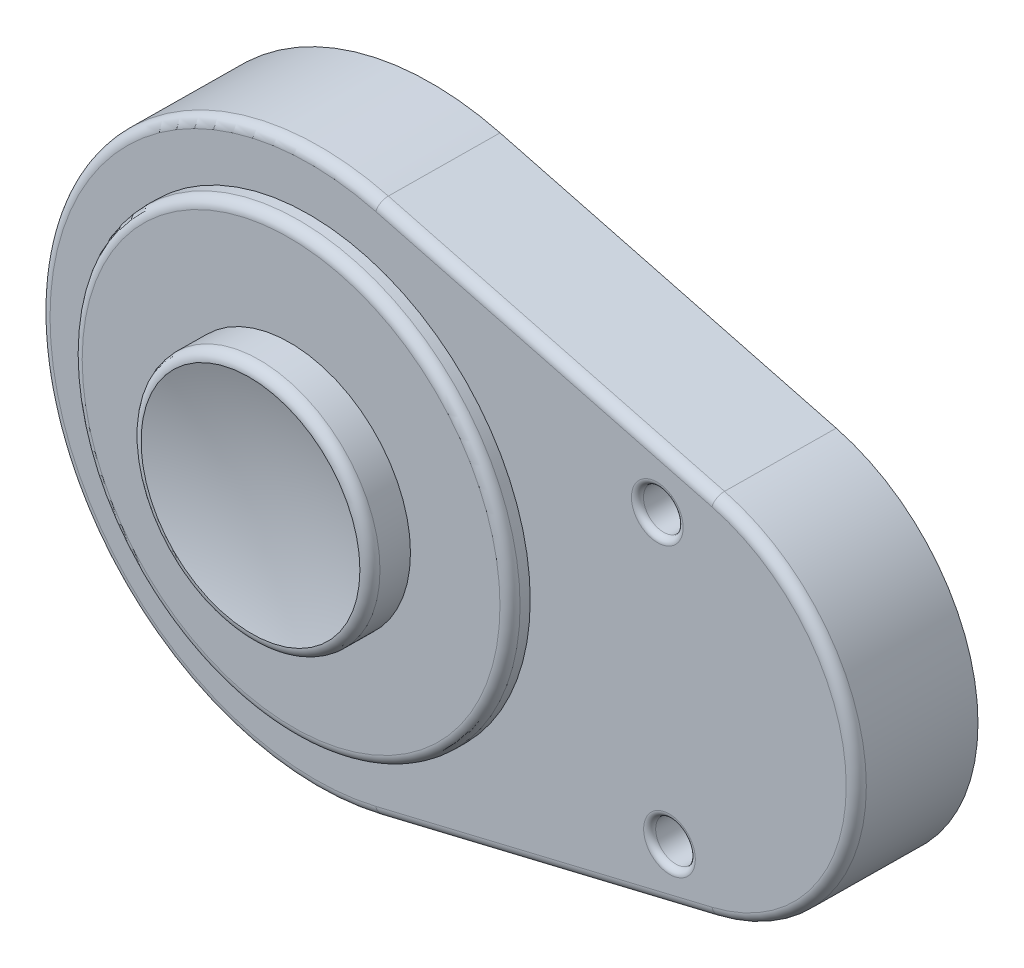
ISO-10303-21;
HEADER;
FILE_DESCRIPTION(('STEP AP214'),'2;1');
FILE_NAME('part.step','',(''),(''),'','','');
FILE_SCHEMA(('AUTOMOTIVE_DESIGN { 1 0 10303 214 1 1 1 1 }'));
ENDSEC;
DATA;
#1=APPLICATION_CONTEXT('core data for automotive mechanical design processes');
#2=APPLICATION_PROTOCOL_DEFINITION('international standard','automotive_design',2000,#1);
#3=PRODUCT_CONTEXT('',#1,'mechanical');
#4=PRODUCT('Part','Part','',(#3));
#5=PRODUCT_RELATED_PRODUCT_CATEGORY('part','',(#4));
#6=PRODUCT_DEFINITION_FORMATION('','',#4);
#7=PRODUCT_DEFINITION_CONTEXT('part definition',#1,'design');
#8=PRODUCT_DEFINITION('design','',#6,#7);
#9=PRODUCT_DEFINITION_SHAPE('','',#8);
#10=(LENGTH_UNIT() NAMED_UNIT(*) SI_UNIT(.MILLI.,.METRE.));
#11=(NAMED_UNIT(*) PLANE_ANGLE_UNIT() SI_UNIT($,.RADIAN.));
#12=(NAMED_UNIT(*) SI_UNIT($,.STERADIAN.) SOLID_ANGLE_UNIT());
#13=UNCERTAINTY_MEASURE_WITH_UNIT(LENGTH_MEASURE(1.E-05),#10,'distance_accuracy_value','');
#14=(GEOMETRIC_REPRESENTATION_CONTEXT(3) GLOBAL_UNCERTAINTY_ASSIGNED_CONTEXT((#13)) GLOBAL_UNIT_ASSIGNED_CONTEXT((#10,
#11,#12)) REPRESENTATION_CONTEXT('',''));
#15=CARTESIAN_POINT('',(0.,0.,0.));
#16=DIRECTION('',(0.,0.,1.));
#17=DIRECTION('',(1.,0.,0.));
#18=AXIS2_PLACEMENT_3D('',#15,#16,#17);
#19=CARTESIAN_POINT('',(-0.913899219910125,294.000000000001,89.995359814914));
#20=DIRECTION('',(0.0101544357767432,0.,-0.999948442387934));
#21=DIRECTION('',(-0.999948442387934,0.,-0.0101544357767432));
#22=AXIS2_PLACEMENT_3D('',#19,#20,#21);
#23=CYLINDRICAL_SURFACE('',#22,46.9225149813001);
#24=DIRECTION('',(0.0101544357767432,0.,-0.999948442387934));
#25=VECTOR('',#24,1.);
#26=CARTESIAN_POINT('',(10.3753588625768,339.544065709367,90.1100017717452));
#27=LINE('',#26,#25);
#28=CARTESIAN_POINT('',(10.4007449520186,339.544065709367,87.6101306657754));
#29=VERTEX_POINT('',#28);
#30=CARTESIAN_POINT('',(10.6799919358791,339.544065709367,60.1115485001072));
#31=VERTEX_POINT('',#30);
#32=EDGE_CURVE('E87',#29,#31,#27,.T.);
#33=ORIENTED_EDGE('',*,*,#32,.F.);
#34=CARTESIAN_POINT('',(-0.888513130468267,294.000000000001,87.4954887089442));
#35=DIRECTION('',(-0.0101544357767432,0.,0.999948442387934));
#36=DIRECTION('',(0.999948442387934,0.,0.0101544357767432));
#37=AXIS2_PLACEMENT_3D('',#34,#35,#36);
#38=CIRCLE('',#37,46.9225149813001);
#39=CARTESIAN_POINT('',(10.4007449520186,248.455934290634,87.6101306657754));
#40=VERTEX_POINT('',#39);
#41=EDGE_CURVE('E145',#29,#40,#38,.F.);
#42=ORIENTED_EDGE('',*,*,#41,.T.);
#43=DIRECTION('',(0.0101544357767432,0.,-0.999948442387934));
#44=VECTOR('',#43,1.);
#45=CARTESIAN_POINT('',(10.3753588625768,248.455934290634,90.1100017717452));
#46=LINE('',#45,#44);
#47=CARTESIAN_POINT('',(10.6799919358791,248.455934290634,60.1115485001072));
#48=VERTEX_POINT('',#47);
#49=EDGE_CURVE('E109',#40,#48,#46,.T.);
#50=ORIENTED_EDGE('',*,*,#49,.T.);
#51=CARTESIAN_POINT('',(-0.609266146607829,294.000000000001,59.996906543276));
#52=DIRECTION('',(-0.0101544357767432,0.,0.999948442387934));
#53=DIRECTION('',(0.999948442387934,0.,0.0101544357767432));
#54=AXIS2_PLACEMENT_3D('',#51,#52,#53);
#55=CIRCLE('',#54,46.9225149813001);
#56=EDGE_CURVE('E105',#48,#31,#55,.T.);
#57=ORIENTED_EDGE('',*,*,#56,.T.);
#58=EDGE_LOOP('',(#33,#42,#50,#57));
#59=FACE_BOUND('',#58,.T.);
#60=ADVANCED_FACE('F32',(#59),#23,.T.);
#61=CARTESIAN_POINT('',(10.3753588625768,339.544065709367,90.1100017717452));
#62=DIRECTION('',(-0.240593627323387,-0.970622860422481,-0.00244321850346071));
#63=DIRECTION('',(0.970625757413055,-0.240594345416375,0.));
#64=AXIS2_PLACEMENT_3D('',#61,#62,#63);
#65=PLANE('',#64);
#66=DIRECTION('',(0.0101544357767432,0.,-0.999948442387934));
#67=VECTOR('',#66,1.);
#68=CARTESIAN_POINT('',(-74.1083462192989,360.487665938941,89.2520731815606));
#69=LINE('',#68,#67);
#70=CARTESIAN_POINT('',(-74.082960129857,360.487665938941,86.7522020755908));
#71=VERTEX_POINT('',#70);
#72=CARTESIAN_POINT('',(-73.8037131459966,360.487665938941,59.2536199099226));
#73=VERTEX_POINT('',#72);
#74=EDGE_CURVE('E99',#71,#73,#69,.T.);
#75=ORIENTED_EDGE('',*,*,#74,.F.);
#76=DIRECTION('',(-0.970572817425582,0.240606032395866,-0.00985612749959888));
#77=VECTOR('',#76,1.);
#78=CARTESIAN_POINT('',(10.4007449520186,339.544065709367,87.6101306657754));
#79=LINE('',#78,#77);
#80=EDGE_CURVE('E93',#71,#29,#79,.F.);
#81=ORIENTED_EDGE('',*,*,#80,.T.);
#82=ORIENTED_EDGE('',*,*,#32,.T.);
#83=DIRECTION('',(-0.970572817425581,0.240606032395866,-0.00985612749959894));
#84=VECTOR('',#83,1.);
#85=CARTESIAN_POINT('',(10.6799919358791,339.544065709367,60.1115485001072));
#86=LINE('',#85,#84);
#87=EDGE_CURVE('E90',#31,#73,#86,.T.);
#88=ORIENTED_EDGE('',*,*,#87,.T.);
#89=EDGE_LOOP('',(#75,#81,#82,#88));
#90=FACE_BOUND('',#89,.T.);
#91=ADVANCED_FACE('F89',(#90),#65,.F.);
#92=CARTESIAN_POINT('',(-90.5890096909508,294.000000000001,89.0847127140735));
#93=DIRECTION('',(0.0101544357767432,0.,-0.999948442387934));
#94=DIRECTION('',(-0.999948442387934,0.,-0.0101544357767432));
#95=AXIS2_PLACEMENT_3D('',#92,#93,#94);
#96=CYLINDRICAL_SURFACE('',#95,68.5);
#97=DIRECTION('',(0.0101544357767432,0.,-0.999948442387934));
#98=VECTOR('',#97,1.);
#99=CARTESIAN_POINT('',(-74.1083462192989,227.512334061061,89.2520731815606));
#100=LINE('',#99,#98);
#101=CARTESIAN_POINT('',(-74.082960129857,227.512334061061,86.7522020755908));
#102=VERTEX_POINT('',#101);
#103=CARTESIAN_POINT('',(-73.8037131459966,227.512334061061,59.2536199099226));
#104=VERTEX_POINT('',#103);
#105=EDGE_CURVE('E123',#102,#104,#100,.T.);
#106=ORIENTED_EDGE('',*,*,#105,.F.);
#107=CARTESIAN_POINT('',(-90.563623601509,294.000000000001,86.5848416081037));
#108=DIRECTION('',(-0.0101544357767432,0.,0.999948442387934));
#109=DIRECTION('',(0.999948442387934,0.,0.0101544357767432));
#110=AXIS2_PLACEMENT_3D('',#107,#108,#109);
#111=CIRCLE('',#110,68.5);
#112=EDGE_CURVE('E48',#102,#71,#111,.F.);
#113=ORIENTED_EDGE('',*,*,#112,.T.);
#114=ORIENTED_EDGE('',*,*,#74,.T.);
#115=CARTESIAN_POINT('',(-90.2843766176485,294.000000000001,59.0862594424355));
#116=DIRECTION('',(-0.0101544357767432,0.,0.999948442387934));
#117=DIRECTION('',(0.999948442387934,0.,0.0101544357767432));
#118=AXIS2_PLACEMENT_3D('',#115,#116,#117);
#119=CIRCLE('',#118,68.5);
#120=EDGE_CURVE('E107',#73,#104,#119,.T.);
#121=ORIENTED_EDGE('',*,*,#120,.T.);
#122=EDGE_LOOP('',(#106,#113,#114,#121));
#123=FACE_BOUND('',#122,.T.);
#124=ADVANCED_FACE('F216',(#123),#96,.T.);
#125=CARTESIAN_POINT('',(-74.1083462192989,227.512334061061,89.2520731815606));
#126=DIRECTION('',(-0.240593627323385,0.970622860422482,-0.0024432185034609));
#127=DIRECTION('',(-0.970625757413055,-0.240594345416374,0.));
#128=AXIS2_PLACEMENT_3D('',#125,#126,#127);
#129=PLANE('',#128);
#130=ORIENTED_EDGE('',*,*,#49,.F.);
#131=DIRECTION('',(0.970572817425582,0.240606032395864,0.00985612749959883));
#132=VECTOR('',#131,1.);
#133=CARTESIAN_POINT('',(-74.082960129857,227.512334061061,86.7522020755908));
#134=LINE('',#133,#132);
#135=EDGE_CURVE('E56',#40,#102,#134,.F.);
#136=ORIENTED_EDGE('',*,*,#135,.T.);
#137=ORIENTED_EDGE('',*,*,#105,.T.);
#138=DIRECTION('',(0.970572817425582,0.240606032395864,0.00985612749959879));
#139=VECTOR('',#138,1.);
#140=CARTESIAN_POINT('',(-73.8037131459966,227.512334061061,59.2536199099226));
#141=LINE('',#140,#139);
#142=EDGE_CURVE('E120',#104,#48,#141,.T.);
#143=ORIENTED_EDGE('',*,*,#142,.T.);
#144=EDGE_LOOP('',(#130,#136,#137,#143));
#145=FACE_BOUND('',#144,.T.);
#146=ADVANCED_FACE('F208',(#145),#129,.F.);
#147=CARTESIAN_POINT('',(-0.913899219910125,294.000000000001,89.995359814914));
#148=DIRECTION('',(-0.0101544357767432,0.,0.999948442387934));
#149=DIRECTION('',(0.999948442387934,0.,0.0101544357767432));
#150=AXIS2_PLACEMENT_3D('',#147,#148,#149);
#151=PLANE('',#150);
#152=CARTESIAN_POINT('',(-0.913899219910086,259.067133874063,89.995359814914));
#153=DIRECTION('',(-0.0101544357767432,0.,0.999948442387934));
#154=DIRECTION('',(0.999948442387934,0.,0.0101544357767432));
#155=AXIS2_PLACEMENT_3D('',#152,#153,#154);
#156=CIRCLE('',#155,6.50000000000002);
#157=CARTESIAN_POINT('',(5.58576565561151,259.067133874063,90.0613636474629));
#158=VERTEX_POINT('',#157);
#159=EDGE_CURVE('E41',#158,#158,#156,.F.);
#160=ORIENTED_EDGE('',*,*,#159,.T.);
#161=EDGE_LOOP('',(#160));
#162=FACE_BOUND('',#161,.T.);
#163=CARTESIAN_POINT('',(-3.97874289420973,329.000000000001,89.9642364520113));
#164=DIRECTION('',(-0.0101544357767432,0.,0.999948442387934));
#165=DIRECTION('',(0.999948442387934,0.,0.0101544357767432));
#166=AXIS2_PLACEMENT_3D('',#163,#164,#165);
#167=CIRCLE('',#166,6.5);
#168=CARTESIAN_POINT('',(2.52092198131185,329.000000000001,90.0302402845602));
#169=VERTEX_POINT('',#168);
#170=EDGE_CURVE('E171',#169,#169,#167,.F.);
#171=ORIENTED_EDGE('',*,*,#170,.T.);
#172=EDGE_LOOP('',(#171));
#173=FACE_BOUND('',#172,.T.);
#174=DIRECTION('',(0.970572817425582,0.240606032395864,0.00985612749959883));
#175=VECTOR('',#174,1.);
#176=CARTESIAN_POINT('',(9.77387479426833,250.882491441691,90.1038937254866));
#177=LINE('',#176,#175);
#178=CARTESIAN_POINT('',(-74.7098302876073,229.938891212117,89.245965135302));
#179=VERTEX_POINT('',#178);
#180=CARTESIAN_POINT('',(9.77387479426833,250.882491441691,90.1038937254866));
#181=VERTEX_POINT('',#180);
#182=EDGE_CURVE('E140',#179,#181,#177,.T.);
#183=ORIENTED_EDGE('',*,*,#182,.T.);
#184=CARTESIAN_POINT('',(-0.913899219910125,294.000000000001,89.995359814914));
#185=DIRECTION('',(-0.0101544357767432,0.,0.999948442387934));
#186=DIRECTION('',(0.999948442387934,0.,0.0101544357767432));
#187=AXIS2_PLACEMENT_3D('',#184,#185,#186);
#188=CIRCLE('',#187,44.4225149813001);
#189=CARTESIAN_POINT('',(9.7738747942683,337.117508558311,90.1038937254866));
#190=VERTEX_POINT('',#189);
#191=EDGE_CURVE('E142',#181,#190,#188,.T.);
#192=ORIENTED_EDGE('',*,*,#191,.T.);
#193=DIRECTION('',(-0.970572817425582,0.240606032395866,-0.00985612749959888));
#194=VECTOR('',#193,1.);
#195=CARTESIAN_POINT('',(-74.7098302876074,358.061108787885,89.2459651353019));
#196=LINE('',#195,#194);
#197=CARTESIAN_POINT('',(-74.7098302876074,358.061108787885,89.2459651353019));
#198=VERTEX_POINT('',#197);
#199=EDGE_CURVE('E135',#190,#198,#196,.T.);
#200=ORIENTED_EDGE('',*,*,#199,.T.);
#201=CARTESIAN_POINT('',(-90.5890096909508,294.000000000001,89.0847127140735));
#202=DIRECTION('',(-0.0101544357767432,0.,0.999948442387934));
#203=DIRECTION('',(0.999948442387934,0.,0.0101544357767432));
#204=AXIS2_PLACEMENT_3D('',#201,#202,#203);
#205=CIRCLE('',#204,66.);
#206=EDGE_CURVE('E137',#198,#179,#205,.T.);
#207=ORIENTED_EDGE('',*,*,#206,.T.);
#208=EDGE_LOOP('',(#183,#192,#200,#207));
#209=FACE_BOUND('',#208,.T.);
#210=CARTESIAN_POINT('',(-90.9046190889751,294.000000000001,89.0815077134686));
#211=DIRECTION('',(-0.0101544357767432,0.,0.999948442387934));
#212=DIRECTION('',(0.999948442387934,0.,0.0101544357767432));
#213=AXIS2_PLACEMENT_3D('',#210,#211,#212);
#214=CIRCLE('',#213,55.);
#215=CARTESIAN_POINT('',(-35.9074547576387,294.000000000001,89.6400016811895));
#216=VERTEX_POINT('',#215);
#217=EDGE_CURVE('E98',#216,#216,#214,.T.);
#218=ORIENTED_EDGE('',*,*,#217,.F.);
#219=EDGE_LOOP('',(#218));
#220=FACE_BOUND('',#219,.T.);
#221=ADVANCED_FACE('F177',(#162,#173,#209,#220),#151,.T.);
#222=CARTESIAN_POINT('',(-0.609266146607829,294.000000000001,59.996906543276));
#223=DIRECTION('',(-0.0101544357767432,0.,0.999948442387934));
#224=DIRECTION('',(0.999948442387934,0.,0.0101544357767432));
#225=AXIS2_PLACEMENT_3D('',#222,#223,#224);
#226=PLANE('',#225);
#227=CARTESIAN_POINT('',(-3.67410982090744,329.000000000001,59.9657831803733));
#228=DIRECTION('',(-0.0101544357767432,0.,0.999948442387934));
#229=DIRECTION('',(0.999948442387934,0.,0.0101544357767432));
#230=AXIS2_PLACEMENT_3D('',#227,#228,#229);
#231=CIRCLE('',#230,3.0000000000433);
#232=CARTESIAN_POINT('',(-0.674264493700337,329.000000000001,59.9962464877039));
#233=VERTEX_POINT('',#232);
#234=EDGE_CURVE('E129',#233,#233,#231,.T.);
#235=ORIENTED_EDGE('',*,*,#234,.T.);
#236=EDGE_LOOP('',(#235));
#237=FACE_BOUND('',#236,.T.);
#238=CARTESIAN_POINT('',(-0.60926614660779,259.067133874063,59.996906543276));
#239=DIRECTION('',(-0.0101544357767432,0.,0.999948442387934));
#240=DIRECTION('',(0.999948442387934,0.,0.0101544357767432));
#241=AXIS2_PLACEMENT_3D('',#238,#239,#240);
#242=CIRCLE('',#241,3.00000000022555);
#243=CARTESIAN_POINT('',(2.39057918078155,259.067133874063,60.0273698506085));
#244=VERTEX_POINT('',#243);
#245=EDGE_CURVE('E134',#244,#244,#242,.T.);
#246=ORIENTED_EDGE('',*,*,#245,.T.);
#247=EDGE_LOOP('',(#246));
#248=FACE_BOUND('',#247,.T.);
#249=ORIENTED_EDGE('',*,*,#56,.F.);
#250=ORIENTED_EDGE('',*,*,#142,.F.);
#251=ORIENTED_EDGE('',*,*,#120,.F.);
#252=ORIENTED_EDGE('',*,*,#87,.F.);
#253=EDGE_LOOP('',(#249,#250,#251,#252));
#254=FACE_BOUND('',#253,.T.);
#255=ADVANCED_FACE('F103',(#237,#248,#254),#226,.F.);
#256=CARTESIAN_POINT('',(-90.9553912678588,294.000000000001,94.0812499254083));
#257=DIRECTION('',(0.0101544357767432,0.,-0.999948442387934));
#258=DIRECTION('',(-0.999948442387934,0.,-0.0101544357767432));
#259=AXIS2_PLACEMENT_3D('',#256,#257,#258);
#260=CYLINDRICAL_SURFACE('',#259,55.);
#261=CARTESIAN_POINT('',(-90.930005178417,294.000000000001,91.5813788194384));
#262=DIRECTION('',(-0.0101544357767432,0.,0.999948442387934));
#263=DIRECTION('',(0.999948442387934,0.,0.0101544357767432));
#264=AXIS2_PLACEMENT_3D('',#261,#262,#263);
#265=CIRCLE('',#264,55.);
#266=CARTESIAN_POINT('',(-35.9328408470806,294.000000000001,92.1398727871593));
#267=VERTEX_POINT('',#266);
#268=EDGE_CURVE('E152',#267,#267,#265,.F.);
#269=ORIENTED_EDGE('',*,*,#268,.T.);
#270=EDGE_LOOP('',(#269));
#271=FACE_BOUND('',#270,.T.);
#272=ORIENTED_EDGE('',*,*,#217,.T.);
#273=EDGE_LOOP('',(#272));
#274=FACE_BOUND('',#273,.T.);
#275=ADVANCED_FACE('F205',(#271,#274),#260,.T.);
#276=CARTESIAN_POINT('',(-90.9553912678588,294.000000000001,94.0812499254083));
#277=DIRECTION('',(-0.0101544357767432,0.,0.999948442387934));
#278=DIRECTION('',(0.999948442387934,0.,0.0101544357767432));
#279=AXIS2_PLACEMENT_3D('',#276,#277,#278);
#280=PLANE('',#279);
#281=CARTESIAN_POINT('',(-90.9553912678588,294.000000000001,94.0812499254083));
#282=DIRECTION('',(-0.0101544357767432,0.,0.999948442387934));
#283=DIRECTION('',(0.999948442387934,0.,0.0101544357767432));
#284=AXIS2_PLACEMENT_3D('',#281,#282,#283);
#285=CIRCLE('',#284,52.5);
#286=CARTESIAN_POINT('',(-38.4580980424923,294.000000000001,94.6143578036873));
#287=VERTEX_POINT('',#286);
#288=EDGE_CURVE('E149',#287,#287,#285,.T.);
#289=ORIENTED_EDGE('',*,*,#288,.T.);
#290=EDGE_LOOP('',(#289));
#291=FACE_BOUND('',#290,.T.);
#292=CARTESIAN_POINT('',(-90.9553912678588,294.000000000001,94.0812499254083));
#293=DIRECTION('',(-0.0101544357767432,0.,0.999948442387934));
#294=DIRECTION('',(0.999948442387934,0.,0.0101544357767432));
#295=AXIS2_PLACEMENT_3D('',#292,#293,#294);
#296=CIRCLE('',#295,30.);
#297=CARTESIAN_POINT('',(-60.9569379962208,294.000000000001,94.3858829987106));
#298=VERTEX_POINT('',#297);
#299=EDGE_CURVE('E138',#298,#298,#296,.T.);
#300=ORIENTED_EDGE('',*,*,#299,.F.);
#301=EDGE_LOOP('',(#300));
#302=FACE_BOUND('',#301,.T.);
#303=ADVANCED_FACE('F283',(#291,#302),#280,.T.);
#304=CARTESIAN_POINT('',(-91.0569356256263,294.000000000001,104.080734349288));
#305=DIRECTION('',(0.0101544357767432,0.,-0.999948442387934));
#306=DIRECTION('',(-0.999948442387934,0.,-0.0101544357767432));
#307=AXIS2_PLACEMENT_3D('',#304,#305,#306);
#308=CYLINDRICAL_SURFACE('',#307,30.);
#309=CARTESIAN_POINT('',(-91.0315495361844,294.000000000001,101.580863243318));
#310=DIRECTION('',(-0.0101544357767432,0.,0.999948442387934));
#311=DIRECTION('',(0.999948442387934,0.,0.0101544357767432));
#312=AXIS2_PLACEMENT_3D('',#309,#310,#311);
#313=CIRCLE('',#312,30.);
#314=CARTESIAN_POINT('',(-61.0330962645464,294.000000000001,101.88549631662));
#315=VERTEX_POINT('',#314);
#316=EDGE_CURVE('E155',#315,#315,#313,.F.);
#317=ORIENTED_EDGE('',*,*,#316,.T.);
#318=EDGE_LOOP('',(#317));
#319=FACE_BOUND('',#318,.T.);
#320=ORIENTED_EDGE('',*,*,#299,.T.);
#321=EDGE_LOOP('',(#320));
#322=FACE_BOUND('',#321,.T.);
#323=ADVANCED_FACE('F280',(#319,#322),#308,.T.);
#324=CARTESIAN_POINT('',(-91.996538261093,294.000000000001,196.607213658996));
#325=DIRECTION('',(0.,0.,1.));
#326=DIRECTION('',(1.,0.,0.));
#327=AXIS2_PLACEMENT_3D('',#324,#325,#326);
#328=SPHERICAL_SURFACE('',#327,96.5312499999999);
#329=CARTESIAN_POINT('',(-91.996538261093,294.000000000001,196.607213658996));
#330=DIRECTION('',(-0.0101544357767432,0.,0.999948442387934));
#331=DIRECTION('',(0.999948442387934,0.,0.0101544357767432));
#332=AXIS2_PLACEMENT_3D('',#329,#330,#331);
#333=SPHERICAL_SURFACE('',#332,96.5312499999999);
#334=CARTESIAN_POINT('',(-91.0569356256263,294.000000000001,104.080734349288));
#335=DIRECTION('',(-0.0101544357767432,0.,0.999948442387934));
#336=DIRECTION('',(0.999948442387934,0.,0.0101544357767432));
#337=AXIS2_PLACEMENT_3D('',#334,#335,#336);
#338=CIRCLE('',#337,27.5);
#339=CARTESIAN_POINT('',(-63.5583534599581,294.000000000001,104.359981333148));
#340=VERTEX_POINT('',#339);
#341=EDGE_CURVE('E36',#340,#340,#338,.T.);
#342=ORIENTED_EDGE('',*,*,#341,.T.);
#343=EDGE_LOOP('',(#342));
#344=FACE_BOUND('',#343,.T.);
#345=ADVANCED_FACE('F34',(#344),#333,.F.);
#346=CARTESIAN_POINT('',(-0.710810504375222,259.067133874063,69.9963909671554));
#347=DIRECTION('',(-0.0101544357767432,0.,0.999948442387934));
#348=DIRECTION('',(0.999948442387934,0.,0.0101544357767432));
#349=AXIS2_PLACEMENT_3D('',#346,#347,#348);
#350=CYLINDRICAL_SURFACE('',#349,5.00000000000002);
#351=CARTESIAN_POINT('',(-0.898667566244971,259.067133874063,88.4954371513321));
#352=DIRECTION('',(-0.0101544357767432,0.,0.999948442387934));
#353=DIRECTION('',(0.999948442387934,0.,0.0101544357767432));
#354=AXIS2_PLACEMENT_3D('',#351,#352,#353);
#355=CIRCLE('',#354,5.00000000000002);
#356=CARTESIAN_POINT('',(4.10107464569472,259.067133874063,88.5462093302158));
#357=VERTEX_POINT('',#356);
#358=EDGE_CURVE('E159',#357,#357,#355,.T.);
#359=ORIENTED_EDGE('',*,*,#358,.T.);
#360=EDGE_LOOP('',(#359));
#361=FACE_BOUND('',#360,.T.);
#362=CARTESIAN_POINT('',(-0.710810504375222,259.067133874063,69.9963909671554));
#363=DIRECTION('',(-0.0101544357767432,0.,0.999948442387934));
#364=DIRECTION('',(0.999948442387934,0.,0.0101544357767432));
#365=AXIS2_PLACEMENT_3D('',#362,#363,#364);
#366=CIRCLE('',#365,5.00000000000002);
#367=CARTESIAN_POINT('',(4.28893170756447,259.067133874063,70.0471631460391));
#368=VERTEX_POINT('',#367);
#369=EDGE_CURVE('E114',#368,#368,#366,.T.);
#370=ORIENTED_EDGE('',*,*,#369,.F.);
#371=EDGE_LOOP('',(#370));
#372=FACE_BOUND('',#371,.T.);
#373=ADVANCED_FACE('F188',(#361,#372),#350,.F.);
#374=CARTESIAN_POINT('',(-0.710810504375222,259.067133874063,69.9963909671554));
#375=DIRECTION('',(-0.0101544357767432,0.,0.999948442387934));
#376=DIRECTION('',(0.999948442387934,0.,0.0101544357767432));
#377=AXIS2_PLACEMENT_3D('',#374,#375,#376);
#378=PLANE('',#377);
#379=CARTESIAN_POINT('',(-0.710810504375222,259.067133874063,69.9963909671554));
#380=DIRECTION('',(-0.0101544357767432,0.,0.999948442387934));
#381=DIRECTION('',(0.999948442387934,0.,0.0101544357767432));
#382=AXIS2_PLACEMENT_3D('',#379,#380,#381);
#383=CIRCLE('',#382,3.00000000022555);
#384=CARTESIAN_POINT('',(2.28903482301412,259.067133874063,70.0268542744879));
#385=VERTEX_POINT('',#384);
#386=EDGE_CURVE('E131',#385,#385,#383,.T.);
#387=ORIENTED_EDGE('',*,*,#386,.F.);
#388=EDGE_LOOP('',(#387));
#389=FACE_BOUND('',#388,.T.);
#390=ORIENTED_EDGE('',*,*,#369,.T.);
#391=EDGE_LOOP('',(#390));
#392=FACE_BOUND('',#391,.T.);
#393=ADVANCED_FACE('F191',(#389,#392),#378,.T.);
#394=CARTESIAN_POINT('',(-3.77565417867487,329.000000000001,69.9652676042526));
#395=DIRECTION('',(-0.0101544357767432,0.,0.999948442387934));
#396=DIRECTION('',(0.999948442387934,0.,0.0101544357767432));
#397=AXIS2_PLACEMENT_3D('',#394,#395,#396);
#398=CYLINDRICAL_SURFACE('',#397,5.);
#399=CARTESIAN_POINT('',(-3.96351124054462,329.000000000001,88.4643137884294));
#400=DIRECTION('',(-0.0101544357767432,0.,0.999948442387934));
#401=DIRECTION('',(0.999948442387934,0.,0.0101544357767432));
#402=AXIS2_PLACEMENT_3D('',#399,#400,#401);
#403=CIRCLE('',#402,5.);
#404=CARTESIAN_POINT('',(1.03623097139506,329.000000000001,88.5150859673131));
#405=VERTEX_POINT('',#404);
#406=EDGE_CURVE('E11',#405,#405,#403,.T.);
#407=ORIENTED_EDGE('',*,*,#406,.T.);
#408=EDGE_LOOP('',(#407));
#409=FACE_BOUND('',#408,.T.);
#410=CARTESIAN_POINT('',(-3.77565417867487,329.000000000001,69.9652676042526));
#411=DIRECTION('',(-0.0101544357767432,0.,0.999948442387934));
#412=DIRECTION('',(0.999948442387934,0.,0.0101544357767432));
#413=AXIS2_PLACEMENT_3D('',#410,#411,#412);
#414=CIRCLE('',#413,5.);
#415=CARTESIAN_POINT('',(1.22408803326481,329.000000000001,70.0160397831364));
#416=VERTEX_POINT('',#415);
#417=EDGE_CURVE('E111',#416,#416,#414,.T.);
#418=ORIENTED_EDGE('',*,*,#417,.F.);
#419=EDGE_LOOP('',(#418));
#420=FACE_BOUND('',#419,.T.);
#421=ADVANCED_FACE('F258',(#409,#420),#398,.F.);
#422=CARTESIAN_POINT('',(-3.77565417867487,329.000000000001,69.9652676042526));
#423=DIRECTION('',(-0.0101544357767432,0.,0.999948442387934));
#424=DIRECTION('',(0.999948442387934,0.,0.0101544357767432));
#425=AXIS2_PLACEMENT_3D('',#422,#423,#424);
#426=PLANE('',#425);
#427=CARTESIAN_POINT('',(-3.77565417867487,329.000000000001,69.9652676042526));
#428=DIRECTION('',(-0.0101544357767432,0.,0.999948442387934));
#429=DIRECTION('',(0.999948442387934,0.,0.0101544357767432));
#430=AXIS2_PLACEMENT_3D('',#427,#428,#429);
#431=CIRCLE('',#430,3.0000000000433);
#432=CARTESIAN_POINT('',(-0.775808851467769,329.000000000001,69.9957309115833));
#433=VERTEX_POINT('',#432);
#434=EDGE_CURVE('E126',#433,#433,#431,.T.);
#435=ORIENTED_EDGE('',*,*,#434,.F.);
#436=EDGE_LOOP('',(#435));
#437=FACE_BOUND('',#436,.T.);
#438=ORIENTED_EDGE('',*,*,#417,.T.);
#439=EDGE_LOOP('',(#438));
#440=FACE_BOUND('',#439,.T.);
#441=ADVANCED_FACE('F261',(#437,#440),#426,.T.);
#442=CARTESIAN_POINT('',(-3.65296229209155,329.000000000001,57.8833003162603));
#443=DIRECTION('',(-0.0101544357767432,0.,0.999948442387934));
#444=DIRECTION('',(0.999948442387934,0.,0.0101544357767432));
#445=AXIS2_PLACEMENT_3D('',#442,#443,#444);
#446=CYLINDRICAL_SURFACE('',#445,3.0000000000433);
#447=ORIENTED_EDGE('',*,*,#434,.T.);
#448=EDGE_LOOP('',(#447));
#449=FACE_BOUND('',#448,.T.);
#450=ORIENTED_EDGE('',*,*,#234,.F.);
#451=EDGE_LOOP('',(#450));
#452=FACE_BOUND('',#451,.T.);
#453=ADVANCED_FACE('F266',(#449,#452),#446,.F.);
#454=CARTESIAN_POINT('',(-0.588118617791899,259.067133874063,57.914423679163));
#455=DIRECTION('',(-0.0101544357767432,0.,0.999948442387934));
#456=DIRECTION('',(0.999948442387934,0.,0.0101544357767432));
#457=AXIS2_PLACEMENT_3D('',#454,#455,#456);
#458=CYLINDRICAL_SURFACE('',#457,3.00000000022555);
#459=ORIENTED_EDGE('',*,*,#386,.T.);
#460=EDGE_LOOP('',(#459));
#461=FACE_BOUND('',#460,.T.);
#462=ORIENTED_EDGE('',*,*,#245,.F.);
#463=EDGE_LOOP('',(#462));
#464=FACE_BOUND('',#463,.T.);
#465=ADVANCED_FACE('F243',(#461,#464),#458,.F.);
#466=CARTESIAN_POINT('',(-90.563623601509,294.000000000001,86.5848416081037));
#467=DIRECTION('',(-0.0101544357767432,0.,0.999948442387934));
#468=DIRECTION('',(0.999948442387934,0.,0.0101544357767432));
#469=AXIS2_PLACEMENT_3D('',#466,#467,#468);
#470=TOROIDAL_SURFACE('',#469,66.,2.5);
#471=CARTESIAN_POINT('',(-74.6844441981655,358.061108787885,86.7460940293321));
#472=DIRECTION('',(0.970572817425582,-0.240606032395865,0.0098561274995992));
#473=DIRECTION('',(0.240617719873284,0.970619963159105,0.));
#474=AXIS2_PLACEMENT_3D('',#471,#472,#473);
#475=CIRCLE('',#474,2.5);
#476=EDGE_CURVE('E164',#71,#198,#475,.T.);
#477=ORIENTED_EDGE('',*,*,#476,.F.);
#478=ORIENTED_EDGE('',*,*,#112,.F.);
#479=CARTESIAN_POINT('',(-74.6844441981655,229.938891212117,86.7460940293321));
#480=DIRECTION('',(0.970572817425581,0.240606032395868,0.00985612749959924));
#481=DIRECTION('',(-0.240617719873287,0.970619963159104,0.));
#482=AXIS2_PLACEMENT_3D('',#479,#480,#481);
#483=CIRCLE('',#482,2.5);
#484=EDGE_CURVE('E130',#179,#102,#483,.T.);
#485=ORIENTED_EDGE('',*,*,#484,.F.);
#486=ORIENTED_EDGE('',*,*,#206,.F.);
#487=EDGE_LOOP('',(#477,#478,#485,#486));
#488=FACE_BOUND('',#487,.T.);
#489=ADVANCED_FACE('F239',(#488),#470,.T.);
#490=CARTESIAN_POINT('',(9.79926088371015,250.882491441691,87.6040226195168));
#491=DIRECTION('',(-0.970572817425582,-0.240606032395864,-0.00985612749959883));
#492=DIRECTION('',(0.240617719873283,-0.970619963159105,0.));
#493=AXIS2_PLACEMENT_3D('',#490,#491,#492);
#494=CYLINDRICAL_SURFACE('',#493,2.5);
#495=ORIENTED_EDGE('',*,*,#484,.T.);
#496=ORIENTED_EDGE('',*,*,#135,.F.);
#497=CARTESIAN_POINT('',(9.79926088371019,250.882491441691,87.6040226195168));
#498=DIRECTION('',(0.970572817425582,0.240606032395865,0.00985612749959858));
#499=DIRECTION('',(-0.240617719873284,0.970619963159105,0.));
#500=AXIS2_PLACEMENT_3D('',#497,#498,#499);
#501=CIRCLE('',#500,2.5);
#502=EDGE_CURVE('E162',#181,#40,#501,.T.);
#503=ORIENTED_EDGE('',*,*,#502,.F.);
#504=ORIENTED_EDGE('',*,*,#182,.F.);
#505=EDGE_LOOP('',(#495,#496,#503,#504));
#506=FACE_BOUND('',#505,.T.);
#507=ADVANCED_FACE('F235',(#506),#494,.T.);
#508=CARTESIAN_POINT('',(9.79926088371021,337.117508558311,87.6040226195168));
#509=DIRECTION('',(0.970572817425582,-0.240606032395866,0.00985612749959888));
#510=DIRECTION('',(0.240617719873285,0.970619963159104,0.));
#511=AXIS2_PLACEMENT_3D('',#508,#509,#510);
#512=CYLINDRICAL_SURFACE('',#511,2.5);
#513=ORIENTED_EDGE('',*,*,#476,.T.);
#514=ORIENTED_EDGE('',*,*,#199,.F.);
#515=CARTESIAN_POINT('',(9.79926088371015,337.117508558311,87.6040226195168));
#516=DIRECTION('',(0.970572817425582,-0.240606032395865,0.00985612749959723));
#517=DIRECTION('',(0.240617719873284,0.970619963159105,0.));
#518=AXIS2_PLACEMENT_3D('',#515,#516,#517);
#519=CIRCLE('',#518,2.5);
#520=EDGE_CURVE('E160',#29,#190,#519,.T.);
#521=ORIENTED_EDGE('',*,*,#520,.F.);
#522=ORIENTED_EDGE('',*,*,#80,.F.);
#523=EDGE_LOOP('',(#513,#514,#521,#522));
#524=FACE_BOUND('',#523,.T.);
#525=ADVANCED_FACE('F231',(#524),#512,.T.);
#526=CARTESIAN_POINT('',(-0.888513130468267,294.000000000001,87.4954887089442));
#527=DIRECTION('',(-0.0101544357767432,0.,0.999948442387934));
#528=DIRECTION('',(0.999948442387934,0.,0.0101544357767432));
#529=AXIS2_PLACEMENT_3D('',#526,#527,#528);
#530=TOROIDAL_SURFACE('',#529,44.4225149813001,2.5);
#531=ORIENTED_EDGE('',*,*,#502,.T.);
#532=ORIENTED_EDGE('',*,*,#41,.F.);
#533=ORIENTED_EDGE('',*,*,#520,.T.);
#534=ORIENTED_EDGE('',*,*,#191,.F.);
#535=EDGE_LOOP('',(#531,#532,#533,#534));
#536=FACE_BOUND('',#535,.T.);
#537=ADVANCED_FACE('F227',(#536),#530,.T.);
#538=CARTESIAN_POINT('',(-90.930005178417,294.000000000001,91.5813788194385));
#539=DIRECTION('',(-0.0101544357767432,0.,0.999948442387934));
#540=DIRECTION('',(0.999948442387934,0.,0.0101544357767432));
#541=AXIS2_PLACEMENT_3D('',#538,#539,#540);
#542=TOROIDAL_SURFACE('',#541,52.5,2.5);
#543=ORIENTED_EDGE('',*,*,#268,.F.);
#544=EDGE_LOOP('',(#543));
#545=FACE_BOUND('',#544,.T.);
#546=ORIENTED_EDGE('',*,*,#288,.F.);
#547=EDGE_LOOP('',(#546));
#548=FACE_BOUND('',#547,.T.);
#549=ADVANCED_FACE('F230',(#545,#548),#542,.T.);
#550=CARTESIAN_POINT('',(-91.0315495361844,294.000000000001,101.580863243318));
#551=DIRECTION('',(-0.0101544357767432,0.,0.999948442387934));
#552=DIRECTION('',(0.999948442387934,0.,0.0101544357767432));
#553=AXIS2_PLACEMENT_3D('',#550,#551,#552);
#554=TOROIDAL_SURFACE('',#553,27.5,2.5);
#555=ORIENTED_EDGE('',*,*,#316,.F.);
#556=EDGE_LOOP('',(#555));
#557=FACE_BOUND('',#556,.T.);
#558=ORIENTED_EDGE('',*,*,#341,.F.);
#559=EDGE_LOOP('',(#558));
#560=FACE_BOUND('',#559,.T.);
#561=ADVANCED_FACE('F184',(#557,#560),#554,.T.);
#562=CARTESIAN_POINT('',(-0.898667566244971,259.067133874063,88.4954371513321));
#563=DIRECTION('',(-0.0101544357767432,0.,0.999948442387934));
#564=DIRECTION('',(0.999948442387934,0.,0.0101544357767432));
#565=AXIS2_PLACEMENT_3D('',#562,#563,#564);
#566=TOROIDAL_SURFACE('',#565,6.50000000000002,1.5);
#567=ORIENTED_EDGE('',*,*,#159,.F.);
#568=EDGE_LOOP('',(#567));
#569=FACE_BOUND('',#568,.T.);
#570=ORIENTED_EDGE('',*,*,#358,.F.);
#571=EDGE_LOOP('',(#570));
#572=FACE_BOUND('',#571,.T.);
#573=ADVANCED_FACE('F180',(#569,#572),#566,.T.);
#574=CARTESIAN_POINT('',(-3.96351124054462,329.000000000001,88.4643137884294));
#575=DIRECTION('',(-0.0101544357767432,0.,0.999948442387934));
#576=DIRECTION('',(0.999948442387934,0.,0.0101544357767432));
#577=AXIS2_PLACEMENT_3D('',#574,#575,#576);
#578=TOROIDAL_SURFACE('',#577,6.5,1.5);
#579=ORIENTED_EDGE('',*,*,#170,.F.);
#580=EDGE_LOOP('',(#579));
#581=FACE_BOUND('',#580,.T.);
#582=ORIENTED_EDGE('',*,*,#406,.F.);
#583=EDGE_LOOP('',(#582));
#584=FACE_BOUND('',#583,.T.);
#585=ADVANCED_FACE('F183',(#581,#584),#578,.T.);
#586=CLOSED_SHELL('',(#60,#91,#124,#146,#221,#255,#275,#303,#323,#345,#373,#393,#421,#441,#453,
#465,#489,#507,#525,#537,#549,#561,#573,#585));
#587=MANIFOLD_SOLID_BREP('B2',#586);
#588=ADVANCED_BREP_SHAPE_REPRESENTATION('',(#18,#587),#14);
#589=SHAPE_DEFINITION_REPRESENTATION(#9,#588);
ENDSEC;
END-ISO-10303-21;
